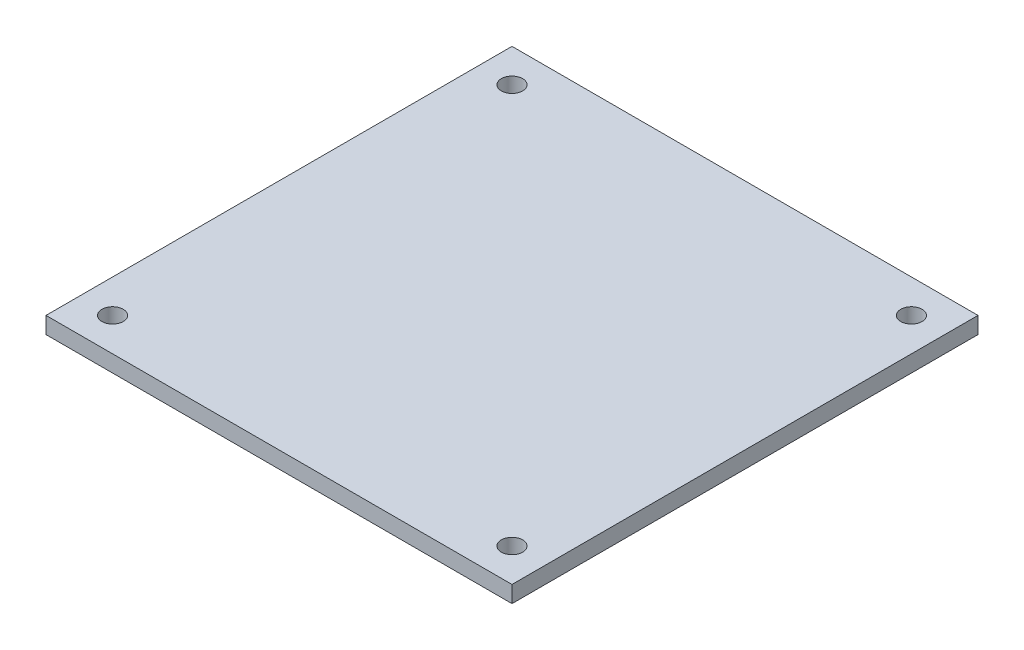
ISO-10303-21;
HEADER;
FILE_DESCRIPTION(('STEP AP214'),'2;1');
FILE_NAME('part.step','',(''),(''),'','','');
FILE_SCHEMA(('AUTOMOTIVE_DESIGN { 1 0 10303 214 1 1 1 1 }'));
ENDSEC;
DATA;
#1=APPLICATION_CONTEXT('core data for automotive mechanical design processes');
#2=APPLICATION_PROTOCOL_DEFINITION('international standard','automotive_design',2000,#1);
#3=PRODUCT_CONTEXT('',#1,'mechanical');
#4=PRODUCT('Part','Part','',(#3));
#5=PRODUCT_RELATED_PRODUCT_CATEGORY('part','',(#4));
#6=PRODUCT_DEFINITION_FORMATION('','',#4);
#7=PRODUCT_DEFINITION_CONTEXT('part definition',#1,'design');
#8=PRODUCT_DEFINITION('design','',#6,#7);
#9=PRODUCT_DEFINITION_SHAPE('','',#8);
#10=(LENGTH_UNIT() NAMED_UNIT(*) SI_UNIT(.MILLI.,.METRE.));
#11=(NAMED_UNIT(*) PLANE_ANGLE_UNIT() SI_UNIT($,.RADIAN.));
#12=(NAMED_UNIT(*) SI_UNIT($,.STERADIAN.) SOLID_ANGLE_UNIT());
#13=UNCERTAINTY_MEASURE_WITH_UNIT(LENGTH_MEASURE(1.E-05),#10,'distance_accuracy_value','');
#14=(GEOMETRIC_REPRESENTATION_CONTEXT(3) GLOBAL_UNCERTAINTY_ASSIGNED_CONTEXT((#13)) GLOBAL_UNIT_ASSIGNED_CONTEXT((#10,
#11,#12)) REPRESENTATION_CONTEXT('',''));
#15=CARTESIAN_POINT('',(0.,0.,0.));
#16=DIRECTION('',(0.,0.,1.));
#17=DIRECTION('',(1.,0.,0.));
#18=AXIS2_PLACEMENT_3D('',#15,#16,#17);
#19=CARTESIAN_POINT('',(-44.45,3.175,0.));
#20=DIRECTION('',(-1.,0.,0.));
#21=DIRECTION('',(0.,0.,1.));
#22=AXIS2_PLACEMENT_3D('',#19,#20,#21);
#23=PLANE('',#22);
#24=DIRECTION('',(0.,0.,-1.));
#25=VECTOR('',#24,1.);
#26=CARTESIAN_POINT('',(-44.45,0.,0.));
#27=LINE('',#26,#25);
#28=CARTESIAN_POINT('',(-44.45,0.,44.45));
#29=VERTEX_POINT('',#28);
#30=CARTESIAN_POINT('',(-44.45,0.,-44.45));
#31=VERTEX_POINT('',#30);
#32=EDGE_CURVE('E134',#29,#31,#27,.T.);
#33=ORIENTED_EDGE('',*,*,#32,.F.);
#34=DIRECTION('',(0.,-1.,0.));
#35=VECTOR('',#34,1.);
#36=CARTESIAN_POINT('',(-44.45,3.175,44.45));
#37=LINE('',#36,#35);
#38=CARTESIAN_POINT('',(-44.45,3.175,44.45));
#39=VERTEX_POINT('',#38);
#40=EDGE_CURVE('E11',#39,#29,#37,.T.);
#41=ORIENTED_EDGE('',*,*,#40,.F.);
#42=DIRECTION('',(0.,0.,-1.));
#43=VECTOR('',#42,1.);
#44=CARTESIAN_POINT('',(-44.45,3.175,0.));
#45=LINE('',#44,#43);
#46=CARTESIAN_POINT('',(-44.45,3.175,-44.45));
#47=VERTEX_POINT('',#46);
#48=EDGE_CURVE('E108',#39,#47,#45,.T.);
#49=ORIENTED_EDGE('',*,*,#48,.T.);
#50=DIRECTION('',(0.,-1.,0.));
#51=VECTOR('',#50,1.);
#52=CARTESIAN_POINT('',(-44.45,3.175,-44.45));
#53=LINE('',#52,#51);
#54=EDGE_CURVE('E84',#47,#31,#53,.T.);
#55=ORIENTED_EDGE('',*,*,#54,.T.);
#56=EDGE_LOOP('',(#33,#41,#49,#55));
#57=FACE_BOUND('',#56,.T.);
#58=ADVANCED_FACE('F43',(#57),#23,.T.);
#59=CARTESIAN_POINT('',(0.,3.175,44.45));
#60=DIRECTION('',(0.,0.,1.));
#61=DIRECTION('',(1.,0.,0.));
#62=AXIS2_PLACEMENT_3D('',#59,#60,#61);
#63=PLANE('',#62);
#64=DIRECTION('',(-1.,0.,0.));
#65=VECTOR('',#64,1.);
#66=CARTESIAN_POINT('',(0.,0.,44.45));
#67=LINE('',#66,#65);
#68=CARTESIAN_POINT('',(44.45,0.,44.45));
#69=VERTEX_POINT('',#68);
#70=EDGE_CURVE('E96',#69,#29,#67,.T.);
#71=ORIENTED_EDGE('',*,*,#70,.F.);
#72=DIRECTION('',(0.,-1.,0.));
#73=VECTOR('',#72,1.);
#74=CARTESIAN_POINT('',(44.45,3.175,44.45));
#75=LINE('',#74,#73);
#76=CARTESIAN_POINT('',(44.45,3.175,44.45));
#77=VERTEX_POINT('',#76);
#78=EDGE_CURVE('E53',#77,#69,#75,.T.);
#79=ORIENTED_EDGE('',*,*,#78,.F.);
#80=DIRECTION('',(-1.,0.,0.));
#81=VECTOR('',#80,1.);
#82=CARTESIAN_POINT('',(0.,3.175,44.45));
#83=LINE('',#82,#81);
#84=EDGE_CURVE('E94',#77,#39,#83,.T.);
#85=ORIENTED_EDGE('',*,*,#84,.T.);
#86=ORIENTED_EDGE('',*,*,#40,.T.);
#87=EDGE_LOOP('',(#71,#79,#85,#86));
#88=FACE_BOUND('',#87,.T.);
#89=ADVANCED_FACE('F92',(#88),#63,.T.);
#90=CARTESIAN_POINT('',(44.45,3.175,0.));
#91=DIRECTION('',(-1.,0.,0.));
#92=DIRECTION('',(0.,0.,1.));
#93=AXIS2_PLACEMENT_3D('',#90,#91,#92);
#94=PLANE('',#93);
#95=DIRECTION('',(0.,0.,-1.));
#96=VECTOR('',#95,1.);
#97=CARTESIAN_POINT('',(44.45,0.,0.));
#98=LINE('',#97,#96);
#99=CARTESIAN_POINT('',(44.45,0.,-44.45));
#100=VERTEX_POINT('',#99);
#101=EDGE_CURVE('E139',#69,#100,#98,.T.);
#102=ORIENTED_EDGE('',*,*,#101,.T.);
#103=DIRECTION('',(0.,-1.,0.));
#104=VECTOR('',#103,1.);
#105=CARTESIAN_POINT('',(44.45,3.175,-44.45));
#106=LINE('',#105,#104);
#107=CARTESIAN_POINT('',(44.45,3.175,-44.45));
#108=VERTEX_POINT('',#107);
#109=EDGE_CURVE('E100',#108,#100,#106,.T.);
#110=ORIENTED_EDGE('',*,*,#109,.F.);
#111=DIRECTION('',(0.,0.,-1.));
#112=VECTOR('',#111,1.);
#113=CARTESIAN_POINT('',(44.45,3.175,0.));
#114=LINE('',#113,#112);
#115=EDGE_CURVE('E102',#77,#108,#114,.T.);
#116=ORIENTED_EDGE('',*,*,#115,.F.);
#117=ORIENTED_EDGE('',*,*,#78,.T.);
#118=EDGE_LOOP('',(#102,#110,#116,#117));
#119=FACE_BOUND('',#118,.T.);
#120=ADVANCED_FACE('F103',(#119),#94,.F.);
#121=CARTESIAN_POINT('',(38.1,3.175,38.1));
#122=DIRECTION('',(0.,-1.,0.));
#123=DIRECTION('',(0.,0.,-1.));
#124=AXIS2_PLACEMENT_3D('',#121,#122,#123);
#125=CYLINDRICAL_SURFACE('',#124,2.032);
#126=CARTESIAN_POINT('',(38.1,3.175,38.1));
#127=DIRECTION('',(0.,1.,0.));
#128=DIRECTION('',(0.,0.,1.));
#129=AXIS2_PLACEMENT_3D('',#126,#127,#128);
#130=CIRCLE('',#129,2.032);
#131=CARTESIAN_POINT('',(38.1,3.175,40.132));
#132=VERTEX_POINT('',#131);
#133=EDGE_CURVE('E118',#132,#132,#130,.T.);
#134=ORIENTED_EDGE('',*,*,#133,.T.);
#135=EDGE_LOOP('',(#134));
#136=FACE_BOUND('',#135,.T.);
#137=CARTESIAN_POINT('',(38.1,0.,38.1));
#138=DIRECTION('',(0.,1.,0.));
#139=DIRECTION('',(0.,0.,1.));
#140=AXIS2_PLACEMENT_3D('',#137,#138,#139);
#141=CIRCLE('',#140,2.032);
#142=CARTESIAN_POINT('',(38.1,0.,40.132));
#143=VERTEX_POINT('',#142);
#144=EDGE_CURVE('E144',#143,#143,#141,.T.);
#145=ORIENTED_EDGE('',*,*,#144,.F.);
#146=EDGE_LOOP('',(#145));
#147=FACE_BOUND('',#146,.T.);
#148=ADVANCED_FACE('F176',(#136,#147),#125,.F.);
#149=CARTESIAN_POINT('',(0.,3.175,-44.45));
#150=DIRECTION('',(0.,0.,1.));
#151=DIRECTION('',(1.,0.,0.));
#152=AXIS2_PLACEMENT_3D('',#149,#150,#151);
#153=PLANE('',#152);
#154=DIRECTION('',(-1.,0.,0.));
#155=VECTOR('',#154,1.);
#156=CARTESIAN_POINT('',(0.,0.,-44.45));
#157=LINE('',#156,#155);
#158=EDGE_CURVE('E77',#100,#31,#157,.T.);
#159=ORIENTED_EDGE('',*,*,#158,.T.);
#160=ORIENTED_EDGE('',*,*,#54,.F.);
#161=DIRECTION('',(-1.,0.,0.));
#162=VECTOR('',#161,1.);
#163=CARTESIAN_POINT('',(0.,3.175,-44.45));
#164=LINE('',#163,#162);
#165=EDGE_CURVE('E61',#108,#47,#164,.T.);
#166=ORIENTED_EDGE('',*,*,#165,.F.);
#167=ORIENTED_EDGE('',*,*,#109,.T.);
#168=EDGE_LOOP('',(#159,#160,#166,#167));
#169=FACE_BOUND('',#168,.T.);
#170=ADVANCED_FACE('F157',(#169),#153,.F.);
#171=CARTESIAN_POINT('',(-38.1,3.175,-38.1));
#172=DIRECTION('',(0.,-1.,0.));
#173=DIRECTION('',(0.,0.,-1.));
#174=AXIS2_PLACEMENT_3D('',#171,#172,#173);
#175=CYLINDRICAL_SURFACE('',#174,2.032);
#176=CARTESIAN_POINT('',(-38.1,3.175,-38.1));
#177=DIRECTION('',(0.,1.,0.));
#178=DIRECTION('',(0.,0.,1.));
#179=AXIS2_PLACEMENT_3D('',#176,#177,#178);
#180=CIRCLE('',#179,2.032);
#181=CARTESIAN_POINT('',(-38.1,3.175,-36.068));
#182=VERTEX_POINT('',#181);
#183=EDGE_CURVE('E112',#182,#182,#180,.T.);
#184=ORIENTED_EDGE('',*,*,#183,.T.);
#185=EDGE_LOOP('',(#184));
#186=FACE_BOUND('',#185,.T.);
#187=CARTESIAN_POINT('',(-38.1,0.,-38.1));
#188=DIRECTION('',(0.,1.,0.));
#189=DIRECTION('',(0.,0.,1.));
#190=AXIS2_PLACEMENT_3D('',#187,#188,#189);
#191=CIRCLE('',#190,2.032);
#192=CARTESIAN_POINT('',(-38.1,0.,-36.068));
#193=VERTEX_POINT('',#192);
#194=EDGE_CURVE('E130',#193,#193,#191,.T.);
#195=ORIENTED_EDGE('',*,*,#194,.F.);
#196=EDGE_LOOP('',(#195));
#197=FACE_BOUND('',#196,.T.);
#198=ADVANCED_FACE('F167',(#186,#197),#175,.F.);
#199=CARTESIAN_POINT('',(38.1,3.175,-38.1));
#200=DIRECTION('',(0.,-1.,0.));
#201=DIRECTION('',(0.,0.,-1.));
#202=AXIS2_PLACEMENT_3D('',#199,#200,#201);
#203=CYLINDRICAL_SURFACE('',#202,2.032);
#204=CARTESIAN_POINT('',(38.1,3.175,-38.1));
#205=DIRECTION('',(0.,1.,0.));
#206=DIRECTION('',(0.,0.,1.));
#207=AXIS2_PLACEMENT_3D('',#204,#205,#206);
#208=CIRCLE('',#207,2.032);
#209=CARTESIAN_POINT('',(38.1,3.175,-36.068));
#210=VERTEX_POINT('',#209);
#211=EDGE_CURVE('E152',#210,#210,#208,.F.);
#212=ORIENTED_EDGE('',*,*,#211,.F.);
#213=EDGE_LOOP('',(#212));
#214=FACE_BOUND('',#213,.T.);
#215=CARTESIAN_POINT('',(38.1,0.,-38.1));
#216=DIRECTION('',(0.,1.,0.));
#217=DIRECTION('',(0.,0.,1.));
#218=AXIS2_PLACEMENT_3D('',#215,#216,#217);
#219=CIRCLE('',#218,2.032);
#220=CARTESIAN_POINT('',(38.1,0.,-36.068));
#221=VERTEX_POINT('',#220);
#222=EDGE_CURVE('E126',#221,#221,#219,.F.);
#223=ORIENTED_EDGE('',*,*,#222,.T.);
#224=EDGE_LOOP('',(#223));
#225=FACE_BOUND('',#224,.T.);
#226=ADVANCED_FACE('F45',(#214,#225),#203,.F.);
#227=CARTESIAN_POINT('',(-38.1,3.175,38.1));
#228=DIRECTION('',(0.,-1.,0.));
#229=DIRECTION('',(0.,0.,-1.));
#230=AXIS2_PLACEMENT_3D('',#227,#228,#229);
#231=CYLINDRICAL_SURFACE('',#230,2.032);
#232=CARTESIAN_POINT('',(-38.1,3.175,38.1));
#233=DIRECTION('',(0.,1.,0.));
#234=DIRECTION('',(0.,0.,1.));
#235=AXIS2_PLACEMENT_3D('',#232,#233,#234);
#236=CIRCLE('',#235,2.032);
#237=CARTESIAN_POINT('',(-38.1,3.175,40.132));
#238=VERTEX_POINT('',#237);
#239=EDGE_CURVE('E122',#238,#238,#236,.F.);
#240=ORIENTED_EDGE('',*,*,#239,.F.);
#241=EDGE_LOOP('',(#240));
#242=FACE_BOUND('',#241,.T.);
#243=CARTESIAN_POINT('',(-38.1,0.,38.1));
#244=DIRECTION('',(0.,1.,0.));
#245=DIRECTION('',(0.,0.,1.));
#246=AXIS2_PLACEMENT_3D('',#243,#244,#245);
#247=CIRCLE('',#246,2.032);
#248=CARTESIAN_POINT('',(-38.1,0.,40.132));
#249=VERTEX_POINT('',#248);
#250=EDGE_CURVE('E148',#249,#249,#247,.F.);
#251=ORIENTED_EDGE('',*,*,#250,.T.);
#252=EDGE_LOOP('',(#251));
#253=FACE_BOUND('',#252,.T.);
#254=ADVANCED_FACE('F174',(#242,#253),#231,.F.);
#255=CARTESIAN_POINT('',(0.,3.175,0.));
#256=DIRECTION('',(0.,1.,0.));
#257=DIRECTION('',(0.,0.,1.));
#258=AXIS2_PLACEMENT_3D('',#255,#256,#257);
#259=PLANE('',#258);
#260=ORIENTED_EDGE('',*,*,#211,.T.);
#261=EDGE_LOOP('',(#260));
#262=FACE_BOUND('',#261,.T.);
#263=ORIENTED_EDGE('',*,*,#183,.F.);
#264=EDGE_LOOP('',(#263));
#265=FACE_BOUND('',#264,.T.);
#266=ORIENTED_EDGE('',*,*,#48,.F.);
#267=ORIENTED_EDGE('',*,*,#84,.F.);
#268=ORIENTED_EDGE('',*,*,#115,.T.);
#269=ORIENTED_EDGE('',*,*,#165,.T.);
#270=EDGE_LOOP('',(#266,#267,#268,#269));
#271=FACE_BOUND('',#270,.T.);
#272=ORIENTED_EDGE('',*,*,#133,.F.);
#273=EDGE_LOOP('',(#272));
#274=FACE_BOUND('',#273,.T.);
#275=ORIENTED_EDGE('',*,*,#239,.T.);
#276=EDGE_LOOP('',(#275));
#277=FACE_BOUND('',#276,.T.);
#278=ADVANCED_FACE('F106',(#262,#265,#271,#274,#277),#259,.T.);
#279=CARTESIAN_POINT('',(0.,0.,0.));
#280=DIRECTION('',(0.,1.,0.));
#281=DIRECTION('',(0.,0.,1.));
#282=AXIS2_PLACEMENT_3D('',#279,#280,#281);
#283=PLANE('',#282);
#284=ORIENTED_EDGE('',*,*,#222,.F.);
#285=EDGE_LOOP('',(#284));
#286=FACE_BOUND('',#285,.T.);
#287=ORIENTED_EDGE('',*,*,#194,.T.);
#288=EDGE_LOOP('',(#287));
#289=FACE_BOUND('',#288,.T.);
#290=ORIENTED_EDGE('',*,*,#32,.T.);
#291=ORIENTED_EDGE('',*,*,#158,.F.);
#292=ORIENTED_EDGE('',*,*,#101,.F.);
#293=ORIENTED_EDGE('',*,*,#70,.T.);
#294=EDGE_LOOP('',(#290,#291,#292,#293));
#295=FACE_BOUND('',#294,.T.);
#296=ORIENTED_EDGE('',*,*,#144,.T.);
#297=EDGE_LOOP('',(#296));
#298=FACE_BOUND('',#297,.T.);
#299=ORIENTED_EDGE('',*,*,#250,.F.);
#300=EDGE_LOOP('',(#299));
#301=FACE_BOUND('',#300,.T.);
#302=ADVANCED_FACE('F158',(#286,#289,#295,#298,#301),#283,.F.);
#303=CLOSED_SHELL('',(#58,#89,#120,#148,#170,#198,#226,#254,#278,#302));
#304=MANIFOLD_SOLID_BREP('B2',#303);
#305=ADVANCED_BREP_SHAPE_REPRESENTATION('',(#18,#304),#14);
#306=SHAPE_DEFINITION_REPRESENTATION(#9,#305);
ENDSEC;
END-ISO-10303-21;
